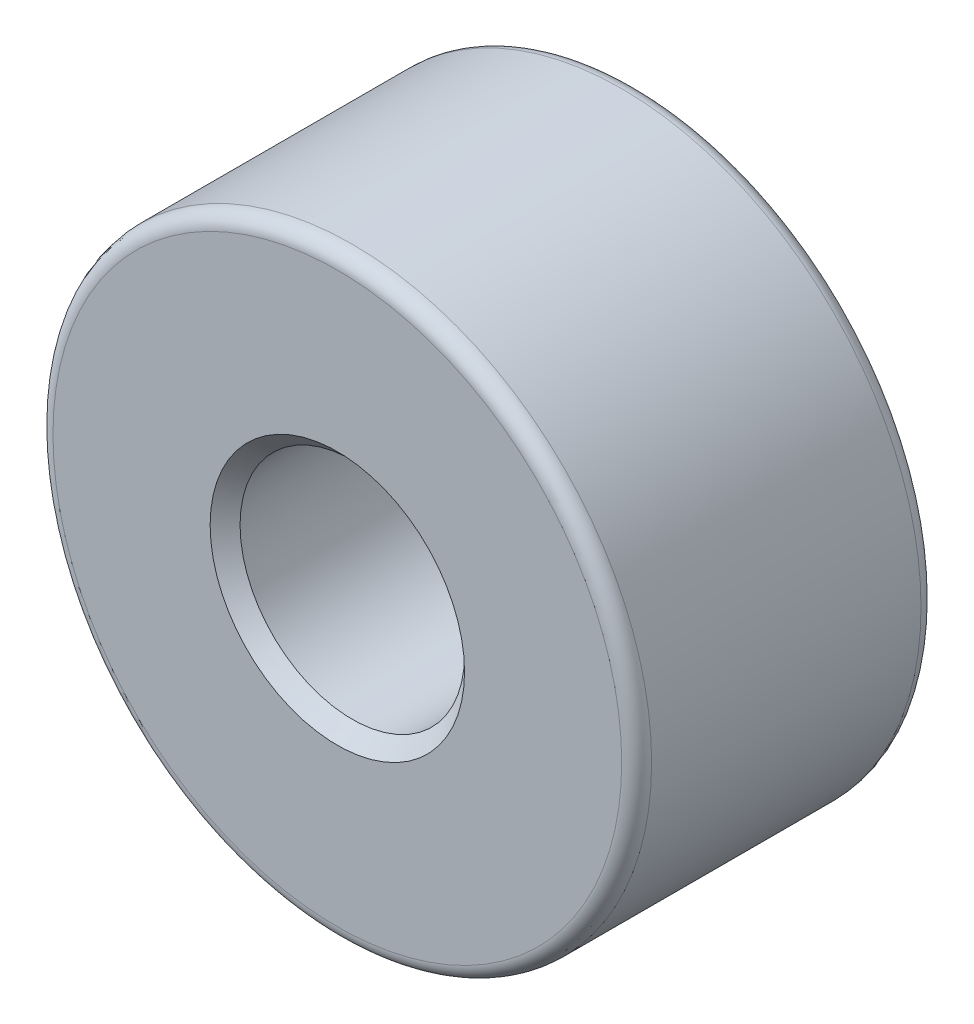
ISO-10303-21;
HEADER;
FILE_DESCRIPTION(('STEP AP214'),'2;1');
FILE_NAME('part.step','',(''),(''),'','','');
FILE_SCHEMA(('AUTOMOTIVE_DESIGN { 1 0 10303 214 1 1 1 1 }'));
ENDSEC;
DATA;
#1=APPLICATION_CONTEXT('core data for automotive mechanical design processes');
#2=APPLICATION_PROTOCOL_DEFINITION('international standard','automotive_design',2000,#1);
#3=PRODUCT_CONTEXT('',#1,'mechanical');
#4=PRODUCT('Part','Part','',(#3));
#5=PRODUCT_RELATED_PRODUCT_CATEGORY('part','',(#4));
#6=PRODUCT_DEFINITION_FORMATION('','',#4);
#7=PRODUCT_DEFINITION_CONTEXT('part definition',#1,'design');
#8=PRODUCT_DEFINITION('design','',#6,#7);
#9=PRODUCT_DEFINITION_SHAPE('','',#8);
#10=(LENGTH_UNIT() NAMED_UNIT(*) SI_UNIT(.MILLI.,.METRE.));
#11=(NAMED_UNIT(*) PLANE_ANGLE_UNIT() SI_UNIT($,.RADIAN.));
#12=(NAMED_UNIT(*) SI_UNIT($,.STERADIAN.) SOLID_ANGLE_UNIT());
#13=UNCERTAINTY_MEASURE_WITH_UNIT(LENGTH_MEASURE(1.E-05),#10,'distance_accuracy_value','');
#14=(GEOMETRIC_REPRESENTATION_CONTEXT(3) GLOBAL_UNCERTAINTY_ASSIGNED_CONTEXT((#13)) GLOBAL_UNIT_ASSIGNED_CONTEXT((#10,
#11,#12)) REPRESENTATION_CONTEXT('',''));
#15=CARTESIAN_POINT('',(0.,0.,0.));
#16=DIRECTION('',(0.,0.,1.));
#17=DIRECTION('',(1.,0.,0.));
#18=AXIS2_PLACEMENT_3D('',#15,#16,#17);
#19=CARTESIAN_POINT('',(0.,0.,4.));
#20=DIRECTION('',(0.,0.,1.));
#21=DIRECTION('',(1.,0.,0.));
#22=AXIS2_PLACEMENT_3D('',#19,#20,#21);
#23=PLANE('',#22);
#24=CARTESIAN_POINT('',(0.,0.,4.));
#25=DIRECTION('',(0.,0.,1.));
#26=DIRECTION('',(1.,0.,0.));
#27=AXIS2_PLACEMENT_3D('',#24,#25,#26);
#28=CIRCLE('',#27,3.8);
#29=CARTESIAN_POINT('',(3.8,0.,4.));
#30=VERTEX_POINT('',#29);
#31=EDGE_CURVE('E10',#30,#30,#28,.T.);
#32=ORIENTED_EDGE('',*,*,#31,.T.);
#33=EDGE_LOOP('',(#32));
#34=FACE_BOUND('',#33,.T.);
#35=CARTESIAN_POINT('',(0.,0.,4.));
#36=DIRECTION('',(0.,0.,1.));
#37=DIRECTION('',(1.,0.,0.));
#38=AXIS2_PLACEMENT_3D('',#35,#36,#37);
#39=CIRCLE('',#38,1.7);
#40=CARTESIAN_POINT('',(1.7,0.,4.));
#41=VERTEX_POINT('',#40);
#42=EDGE_CURVE('E59',#41,#41,#39,.F.);
#43=ORIENTED_EDGE('',*,*,#42,.T.);
#44=EDGE_LOOP('',(#43));
#45=FACE_BOUND('',#44,.T.);
#46=ADVANCED_FACE('F34',(#34,#45),#23,.T.);
#47=CARTESIAN_POINT('',(0.,0.,0.));
#48=DIRECTION('',(0.,0.,1.));
#49=DIRECTION('',(1.,0.,0.));
#50=AXIS2_PLACEMENT_3D('',#47,#48,#49);
#51=PLANE('',#50);
#52=CARTESIAN_POINT('',(0.,0.,0.));
#53=DIRECTION('',(0.,0.,1.));
#54=DIRECTION('',(1.,0.,0.));
#55=AXIS2_PLACEMENT_3D('',#52,#53,#54);
#56=CIRCLE('',#55,3.8);
#57=CARTESIAN_POINT('',(3.8,0.,0.));
#58=VERTEX_POINT('',#57);
#59=EDGE_CURVE('E42',#58,#58,#56,.F.);
#60=ORIENTED_EDGE('',*,*,#59,.T.);
#61=EDGE_LOOP('',(#60));
#62=FACE_BOUND('',#61,.T.);
#63=CARTESIAN_POINT('',(0.,0.,0.));
#64=DIRECTION('',(0.,0.,1.));
#65=DIRECTION('',(1.,0.,0.));
#66=AXIS2_PLACEMENT_3D('',#63,#64,#65);
#67=CIRCLE('',#66,1.7);
#68=CARTESIAN_POINT('',(1.7,0.,0.));
#69=VERTEX_POINT('',#68);
#70=EDGE_CURVE('E68',#69,#69,#67,.T.);
#71=ORIENTED_EDGE('',*,*,#70,.T.);
#72=EDGE_LOOP('',(#71));
#73=FACE_BOUND('',#72,.T.);
#74=ADVANCED_FACE('F73',(#62,#73),#51,.F.);
#75=CARTESIAN_POINT('',(0.,0.,4.));
#76=DIRECTION('',(0.,0.,-1.));
#77=DIRECTION('',(-1.,0.,0.));
#78=AXIS2_PLACEMENT_3D('',#75,#76,#77);
#79=CYLINDRICAL_SURFACE('',#78,4.);
#80=CARTESIAN_POINT('',(0.,0.,0.2));
#81=DIRECTION('',(0.,0.,1.));
#82=DIRECTION('',(1.,0.,0.));
#83=AXIS2_PLACEMENT_3D('',#80,#81,#82);
#84=CIRCLE('',#83,4.);
#85=CARTESIAN_POINT('',(4.,0.,0.2));
#86=VERTEX_POINT('',#85);
#87=EDGE_CURVE('E48',#86,#86,#84,.T.);
#88=ORIENTED_EDGE('',*,*,#87,.T.);
#89=EDGE_LOOP('',(#88));
#90=FACE_BOUND('',#89,.T.);
#91=CARTESIAN_POINT('',(0.,0.,3.8));
#92=DIRECTION('',(0.,0.,1.));
#93=DIRECTION('',(1.,0.,0.));
#94=AXIS2_PLACEMENT_3D('',#91,#92,#93);
#95=CIRCLE('',#94,4.);
#96=CARTESIAN_POINT('',(4.,0.,3.8));
#97=VERTEX_POINT('',#96);
#98=EDGE_CURVE('E54',#97,#97,#95,.F.);
#99=ORIENTED_EDGE('',*,*,#98,.T.);
#100=EDGE_LOOP('',(#99));
#101=FACE_BOUND('',#100,.T.);
#102=ADVANCED_FACE('F88',(#90,#101),#79,.T.);
#103=CARTESIAN_POINT('',(0.,0.,4.));
#104=DIRECTION('',(0.,0.,-1.));
#105=DIRECTION('',(-1.,0.,0.));
#106=AXIS2_PLACEMENT_3D('',#103,#104,#105);
#107=CYLINDRICAL_SURFACE('',#106,1.5);
#108=CARTESIAN_POINT('',(0.,0.,0.200000000000003));
#109=DIRECTION('',(0.,0.,1.));
#110=DIRECTION('',(1.,0.,0.));
#111=AXIS2_PLACEMENT_3D('',#108,#109,#110);
#112=CIRCLE('',#111,1.5);
#113=CARTESIAN_POINT('',(1.5,0.,0.200000000000003));
#114=VERTEX_POINT('',#113);
#115=EDGE_CURVE('E62',#114,#114,#112,.F.);
#116=ORIENTED_EDGE('',*,*,#115,.T.);
#117=EDGE_LOOP('',(#116));
#118=FACE_BOUND('',#117,.T.);
#119=CARTESIAN_POINT('',(0.,0.,3.8));
#120=DIRECTION('',(0.,0.,1.));
#121=DIRECTION('',(1.,0.,0.));
#122=AXIS2_PLACEMENT_3D('',#119,#120,#121);
#123=CIRCLE('',#122,1.5);
#124=CARTESIAN_POINT('',(1.5,0.,3.8));
#125=VERTEX_POINT('',#124);
#126=EDGE_CURVE('E65',#125,#125,#123,.T.);
#127=ORIENTED_EDGE('',*,*,#126,.T.);
#128=EDGE_LOOP('',(#127));
#129=FACE_BOUND('',#128,.T.);
#130=ADVANCED_FACE('F78',(#118,#129),#107,.F.);
#131=CARTESIAN_POINT('',(0.,0.,0.));
#132=DIRECTION('',(0.,0.,-1.));
#133=DIRECTION('',(-1.,0.,0.));
#134=AXIS2_PLACEMENT_3D('',#131,#132,#133);
#135=CONICAL_SURFACE('',#134,1.7,0.785398163397445);
#136=ORIENTED_EDGE('',*,*,#115,.F.);
#137=EDGE_LOOP('',(#136));
#138=FACE_BOUND('',#137,.T.);
#139=ORIENTED_EDGE('',*,*,#70,.F.);
#140=EDGE_LOOP('',(#139));
#141=FACE_BOUND('',#140,.T.);
#142=ADVANCED_FACE('F75',(#138,#141),#135,.F.);
#143=CARTESIAN_POINT('',(0.,0.,3.8));
#144=DIRECTION('',(0.,0.,1.));
#145=DIRECTION('',(1.,0.,0.));
#146=AXIS2_PLACEMENT_3D('',#143,#144,#145);
#147=CONICAL_SURFACE('',#146,1.5,0.785398163397453);
#148=ORIENTED_EDGE('',*,*,#42,.F.);
#149=EDGE_LOOP('',(#148));
#150=FACE_BOUND('',#149,.T.);
#151=ORIENTED_EDGE('',*,*,#126,.F.);
#152=EDGE_LOOP('',(#151));
#153=FACE_BOUND('',#152,.T.);
#154=ADVANCED_FACE('F77',(#150,#153),#147,.F.);
#155=CARTESIAN_POINT('',(0.,0.,0.2));
#156=DIRECTION('',(0.,0.,1.));
#157=DIRECTION('',(1.,0.,0.));
#158=AXIS2_PLACEMENT_3D('',#155,#156,#157);
#159=TOROIDAL_SURFACE('',#158,3.8,0.2);
#160=ORIENTED_EDGE('',*,*,#59,.F.);
#161=EDGE_LOOP('',(#160));
#162=FACE_BOUND('',#161,.T.);
#163=ORIENTED_EDGE('',*,*,#87,.F.);
#164=EDGE_LOOP('',(#163));
#165=FACE_BOUND('',#164,.T.);
#166=ADVANCED_FACE('F85',(#162,#165),#159,.T.);
#167=CARTESIAN_POINT('',(0.,0.,3.8));
#168=DIRECTION('',(0.,0.,1.));
#169=DIRECTION('',(1.,0.,0.));
#170=AXIS2_PLACEMENT_3D('',#167,#168,#169);
#171=TOROIDAL_SURFACE('',#170,3.8,0.2);
#172=ORIENTED_EDGE('',*,*,#98,.F.);
#173=EDGE_LOOP('',(#172));
#174=FACE_BOUND('',#173,.T.);
#175=ORIENTED_EDGE('',*,*,#31,.F.);
#176=EDGE_LOOP('',(#175));
#177=FACE_BOUND('',#176,.T.);
#178=ADVANCED_FACE('F36',(#174,#177),#171,.T.);
#179=CLOSED_SHELL('',(#46,#74,#102,#130,#142,#154,#166,#178));
#180=MANIFOLD_SOLID_BREP('B2',#179);
#181=ADVANCED_BREP_SHAPE_REPRESENTATION('',(#18,#180),#14);
#182=SHAPE_DEFINITION_REPRESENTATION(#9,#181);
ENDSEC;
END-ISO-10303-21;
